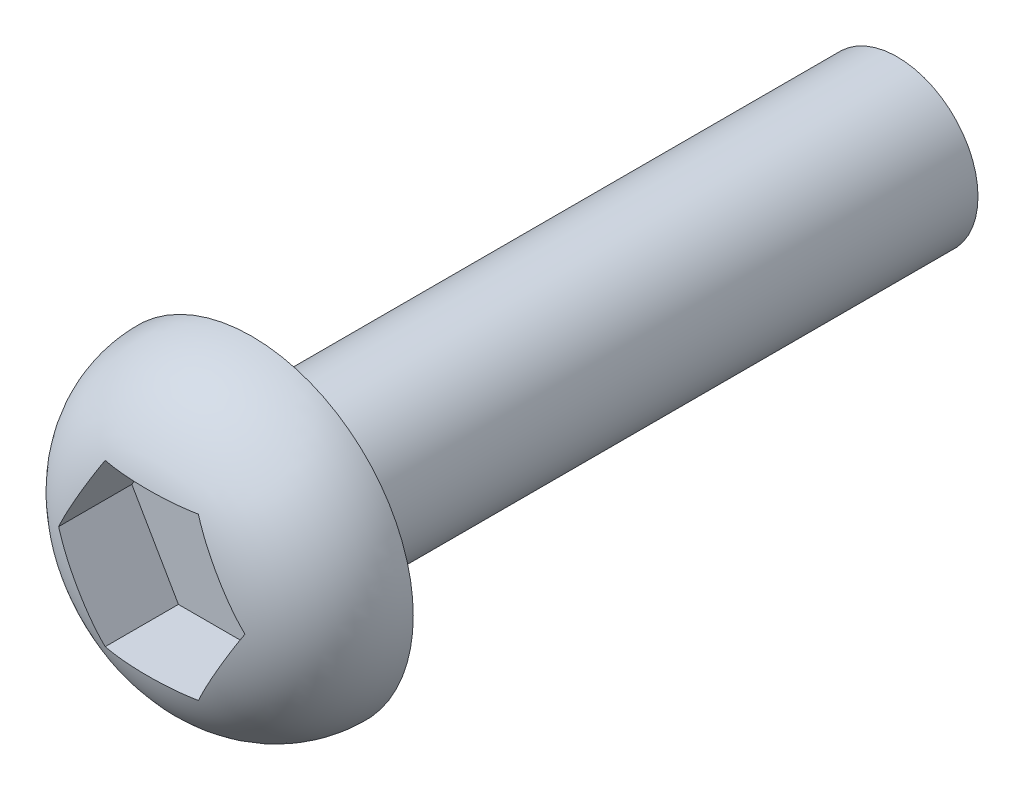
ISO-10303-21;
HEADER;
FILE_DESCRIPTION(('STEP AP214'),'2;1');
FILE_NAME('part.step','',(''),(''),'','','');
FILE_SCHEMA(('AUTOMOTIVE_DESIGN { 1 0 10303 214 1 1 1 1 }'));
ENDSEC;
DATA;
#1=APPLICATION_CONTEXT('core data for automotive mechanical design processes');
#2=APPLICATION_PROTOCOL_DEFINITION('international standard','automotive_design',2000,#1);
#3=PRODUCT_CONTEXT('',#1,'mechanical');
#4=PRODUCT('Part','Part','',(#3));
#5=PRODUCT_RELATED_PRODUCT_CATEGORY('part','',(#4));
#6=PRODUCT_DEFINITION_FORMATION('','',#4);
#7=PRODUCT_DEFINITION_CONTEXT('part definition',#1,'design');
#8=PRODUCT_DEFINITION('design','',#6,#7);
#9=PRODUCT_DEFINITION_SHAPE('','',#8);
#10=(LENGTH_UNIT() NAMED_UNIT(*) SI_UNIT(.MILLI.,.METRE.));
#11=(NAMED_UNIT(*) PLANE_ANGLE_UNIT() SI_UNIT($,.RADIAN.));
#12=(NAMED_UNIT(*) SI_UNIT($,.STERADIAN.) SOLID_ANGLE_UNIT());
#13=UNCERTAINTY_MEASURE_WITH_UNIT(LENGTH_MEASURE(1.E-05),#10,'distance_accuracy_value','');
#14=(GEOMETRIC_REPRESENTATION_CONTEXT(3) GLOBAL_UNCERTAINTY_ASSIGNED_CONTEXT((#13)) GLOBAL_UNIT_ASSIGNED_CONTEXT((#10,
#11,#12)) REPRESENTATION_CONTEXT('',''));
#15=CARTESIAN_POINT('',(0.,0.,0.));
#16=DIRECTION('',(0.,0.,1.));
#17=DIRECTION('',(1.,0.,0.));
#18=AXIS2_PLACEMENT_3D('',#15,#16,#17);
#19=CARTESIAN_POINT('',(0.,0.,12.));
#20=DIRECTION('',(0.,0.,-1.));
#21=DIRECTION('',(-1.,0.,0.));
#22=AXIS2_PLACEMENT_3D('',#19,#20,#21);
#23=CYLINDRICAL_SURFACE('',#22,1.5);
#24=CARTESIAN_POINT('',(0.,0.,12.));
#25=DIRECTION('',(0.,0.,1.));
#26=DIRECTION('',(1.,0.,0.));
#27=AXIS2_PLACEMENT_3D('',#24,#25,#26);
#28=CIRCLE('',#27,1.5);
#29=CARTESIAN_POINT('',(1.5,0.,12.));
#30=VERTEX_POINT('',#29);
#31=EDGE_CURVE('E136',#30,#30,#28,.T.);
#32=ORIENTED_EDGE('',*,*,#31,.F.);
#33=EDGE_LOOP('',(#32));
#34=FACE_BOUND('',#33,.T.);
#35=CARTESIAN_POINT('',(0.,0.,0.));
#36=DIRECTION('',(0.,0.,1.));
#37=DIRECTION('',(1.,0.,0.));
#38=AXIS2_PLACEMENT_3D('',#35,#36,#37);
#39=CIRCLE('',#38,1.5);
#40=CARTESIAN_POINT('',(1.5,0.,0.));
#41=VERTEX_POINT('',#40);
#42=EDGE_CURVE('E135',#41,#41,#39,.T.);
#43=ORIENTED_EDGE('',*,*,#42,.T.);
#44=EDGE_LOOP('',(#43));
#45=FACE_BOUND('',#44,.T.);
#46=ADVANCED_FACE('F33',(#34,#45),#23,.T.);
#47=CARTESIAN_POINT('',(0.,0.,0.));
#48=DIRECTION('',(0.,0.,1.));
#49=DIRECTION('',(1.,0.,0.));
#50=AXIS2_PLACEMENT_3D('',#47,#48,#49);
#51=PLANE('',#50);
#52=ORIENTED_EDGE('',*,*,#42,.F.);
#53=EDGE_LOOP('',(#52));
#54=FACE_BOUND('',#53,.T.);
#55=ADVANCED_FACE('F198',(#54),#51,.F.);
#56=CARTESIAN_POINT('',(0.,0.,12.));
#57=DIRECTION('',(0.,0.,1.));
#58=DIRECTION('',(1.,0.,0.));
#59=AXIS2_PLACEMENT_3D('',#56,#57,#58);
#60=PLANE('',#59);
#61=CARTESIAN_POINT('',(0.,0.,12.));
#62=DIRECTION('',(0.,0.,1.));
#63=DIRECTION('',(1.,0.,0.));
#64=AXIS2_PLACEMENT_3D('',#61,#62,#63);
#65=CIRCLE('',#64,3.);
#66=CARTESIAN_POINT('',(3.,0.,12.));
#67=VERTEX_POINT('',#66);
#68=EDGE_CURVE('E122',#67,#67,#65,.T.);
#69=ORIENTED_EDGE('',*,*,#68,.F.);
#70=EDGE_LOOP('',(#69));
#71=FACE_BOUND('',#70,.T.);
#72=ORIENTED_EDGE('',*,*,#31,.T.);
#73=EDGE_LOOP('',(#72));
#74=FACE_BOUND('',#73,.T.);
#75=ADVANCED_FACE('F203',(#71,#74),#60,.F.);
#76=CARTESIAN_POINT('',(-0.866025403784439,1.5,12.5));
#77=DIRECTION('',(-0.866025403784439,0.5,0.));
#78=DIRECTION('',(-0.5,-0.866025403784439,0.));
#79=AXIS2_PLACEMENT_3D('',#76,#77,#78);
#80=PLANE('',#79);
#81=DIRECTION('',(0.,0.,1.));
#82=VECTOR('',#81,1.);
#83=CARTESIAN_POINT('',(-0.866025403784439,1.5,12.5));
#84=LINE('',#83,#82);
#85=CARTESIAN_POINT('',(-0.866025403784439,1.5,12.5));
#86=VERTEX_POINT('',#85);
#87=CARTESIAN_POINT('',(-0.866025403784439,1.5,13.8612097182042));
#88=VERTEX_POINT('',#87);
#89=EDGE_CURVE('E120',#86,#88,#84,.T.);
#90=ORIENTED_EDGE('',*,*,#89,.T.);
#91=CARTESIAN_POINT('',(-0.866025403784439,1.5,13.8612097182042));
#92=CARTESIAN_POINT('',(-0.897391833782377,1.44567174959152,13.873540669486));
#93=CARTESIAN_POINT('',(-0.92892464211222,1.3910553234589,13.8840270776398));
#94=CARTESIAN_POINT('',(-0.992194875631696,1.28146806439642,13.9017855509481));
#95=CARTESIAN_POINT('',(-1.02393213830263,1.2264975129572,13.9090599102433));
#96=CARTESIAN_POINT('',(-1.08758914147633,1.11624034920279,13.9208966036249));
#97=CARTESIAN_POINT('',(-1.1195091148967,1.06095333346245,13.9254537237836));
#98=CARTESIAN_POINT('',(-1.18341628184974,0.950262873332008,13.9322194029191));
#99=CARTESIAN_POINT('',(-1.21540348834683,0.894859406486848,13.9344274572888));
#100=CARTESIAN_POINT('',(-1.27890034418602,0.784879626052498,13.9366974105321));
#101=CARTESIAN_POINT('',(-1.31040969197492,0.730303834768754,13.9367921199929));
#102=CARTESIAN_POINT('',(-1.37340849088617,0.621186714238655,13.9349234900065));
#103=CARTESIAN_POINT('',(-1.40489794209129,0.566645384848934,13.9329601591783));
#104=CARTESIAN_POINT('',(-1.49923820258182,0.403243260480049,13.923728512142));
#105=CARTESIAN_POINT('',(-1.56203785066875,0.294471079296033,13.9131219149723));
#106=CARTESIAN_POINT('',(-1.63341853637605,0.170836104971893,13.8940897813908));
#107=CARTESIAN_POINT('',(-1.64241142987999,0.155259956516006,13.8915642086321));
#108=CARTESIAN_POINT('',(-1.66037717256051,0.124142377397642,13.8862479221302));
#109=CARTESIAN_POINT('',(-1.66935002317047,0.108600944252471,13.883457228012));
#110=CARTESIAN_POINT('',(-1.68729243270645,0.077523779325944,13.8775937025368));
#111=CARTESIAN_POINT('',(-1.69626194313293,0.0619881315482519,13.8745202778371));
#112=CARTESIAN_POINT('',(-1.71417611106361,0.0309598825170042,13.8680845140849));
#113=CARTESIAN_POINT('',(-1.72312076544713,0.0154672866685937,13.8647221403093));
#114=CARTESIAN_POINT('',(-1.73205080756888,0.,13.8612097182042));
#115=B_SPLINE_CURVE_WITH_KNOTS('',3,(#91,#92,#93,#94,#95,#96,#97,#98,#99,#100,#101,#102,#103,
#104,#105,#106,#107,#108,#109,#110,#111,#112,#113,#114),.UNSPECIFIED.,.F.,.F.,(4,2,2,2,2,2,2,2,
2,2,2,4),(0.,0.191730055441622,0.38332294920206,0.575282304399829,0.767282886407718,
0.956300467202216,1.14531725641134,1.52288979850461,1.57737568295163,1.63185753733722,
1.68645645667214,1.74106194637516),.UNSPECIFIED.);
#116=CARTESIAN_POINT('',(-1.73205080756888,0.,13.8612097182042));
#117=VERTEX_POINT('',#116);
#118=EDGE_CURVE('E60',#88,#117,#115,.T.);
#119=ORIENTED_EDGE('',*,*,#118,.T.);
#120=DIRECTION('',(0.,0.,1.));
#121=VECTOR('',#120,1.);
#122=CARTESIAN_POINT('',(-1.73205080756888,0.,12.5));
#123=LINE('',#122,#121);
#124=CARTESIAN_POINT('',(-1.73205080756888,0.,12.5));
#125=VERTEX_POINT('',#124);
#126=EDGE_CURVE('E91',#125,#117,#123,.T.);
#127=ORIENTED_EDGE('',*,*,#126,.F.);
#128=DIRECTION('',(-0.5,-0.866025403784439,0.));
#129=VECTOR('',#128,1.);
#130=CARTESIAN_POINT('',(-0.866025403784439,1.5,12.5));
#131=LINE('',#130,#129);
#132=EDGE_CURVE('E95',#86,#125,#131,.T.);
#133=ORIENTED_EDGE('',*,*,#132,.F.);
#134=EDGE_LOOP('',(#90,#119,#127,#133));
#135=FACE_BOUND('',#134,.T.);
#136=ADVANCED_FACE('F93',(#135),#80,.F.);
#137=CARTESIAN_POINT('',(0.866025403784439,1.5,12.5));
#138=DIRECTION('',(0.,1.,0.));
#139=DIRECTION('',(0.,0.,1.));
#140=AXIS2_PLACEMENT_3D('',#137,#138,#139);
#141=PLANE('',#140);
#142=DIRECTION('',(0.,0.,1.));
#143=VECTOR('',#142,1.);
#144=CARTESIAN_POINT('',(0.866025403784439,1.5,12.5));
#145=LINE('',#144,#143);
#146=CARTESIAN_POINT('',(0.866025403784439,1.5,12.5));
#147=VERTEX_POINT('',#146);
#148=CARTESIAN_POINT('',(0.866025403784439,1.5,13.8612097182042));
#149=VERTEX_POINT('',#148);
#150=EDGE_CURVE('E123',#147,#149,#145,.T.);
#151=ORIENTED_EDGE('',*,*,#150,.T.);
#152=CARTESIAN_POINT('',(0.866025403784439,1.5,13.8612097182042));
#153=CARTESIAN_POINT('',(0.803292543788564,1.5,13.873540669486));
#154=CARTESIAN_POINT('',(0.740226927128877,1.5,13.8840270776398));
#155=CARTESIAN_POINT('',(0.613686460089926,1.5,13.9017855509481));
#156=CARTESIAN_POINT('',(0.550211934748056,1.5,13.9090599102433));
#157=CARTESIAN_POINT('',(0.422897928400666,1.5,13.9208966036249));
#158=CARTESIAN_POINT('',(0.359057981559912,1.5,13.9254537237836));
#159=CARTESIAN_POINT('',(0.231243647653844,1.5,13.9322194029191));
#160=CARTESIAN_POINT('',(0.167269234659662,1.5,13.9344274572888));
#161=CARTESIAN_POINT('',(0.0402755229812862,1.5,13.9366974105321));
#162=CARTESIAN_POINT('',(-0.0227431725965268,1.5,13.9367921199929));
#163=CARTESIAN_POINT('',(-0.148740770419026,1.5,13.9349234900065));
#164=CARTESIAN_POINT('',(-0.211719672829257,1.5,13.9329601591783));
#165=CARTESIAN_POINT('',(-0.400400193810322,1.5,13.923728512142));
#166=CARTESIAN_POINT('',(-0.525999489984191,1.5,13.9131219149723));
#167=CARTESIAN_POINT('',(-0.66876086139878,1.5,13.8940897813908));
#168=CARTESIAN_POINT('',(-0.686746648406669,1.5,13.8915642086321));
#169=CARTESIAN_POINT('',(-0.722678133767702,1.5,13.8862479221302));
#170=CARTESIAN_POINT('',(-0.740623834987616,1.5,13.883457228012));
#171=CARTESIAN_POINT('',(-0.776508654059577,1.5,13.8775937025368));
#172=CARTESIAN_POINT('',(-0.794447674912549,1.5,13.8745202778371));
#173=CARTESIAN_POINT('',(-0.830276010773896,1.5,13.8680845140849));
#174=CARTESIAN_POINT('',(-0.848165319540947,1.5,13.8647221403093));
#175=CARTESIAN_POINT('',(-0.866025403784443,1.5,13.8612097182042));
#176=B_SPLINE_CURVE_WITH_KNOTS('',3,(#152,#153,#154,#155,#156,#157,#158,#159,#160,#161,#162,
#163,#164,#165,#166,#167,#168,#169,#170,#171,#172,#173,#174,#175),.UNSPECIFIED.,.F.,.F.,(4,2,2,
2,2,2,2,2,2,2,2,4),(0.,0.191730055441623,0.38332294920206,0.57528230439983,0.767282886407718,
0.956300467202216,1.14531725641134,1.52288979850462,1.57737568295163,1.63185753733722,
1.68645645667214,1.74106194637516),.UNSPECIFIED.);
#177=EDGE_CURVE('E179',#149,#88,#176,.T.);
#178=ORIENTED_EDGE('',*,*,#177,.T.);
#179=ORIENTED_EDGE('',*,*,#89,.F.);
#180=DIRECTION('',(-1.,0.,0.));
#181=VECTOR('',#180,1.);
#182=CARTESIAN_POINT('',(0.866025403784439,1.5,12.5));
#183=LINE('',#182,#181);
#184=EDGE_CURVE('E98',#147,#86,#183,.T.);
#185=ORIENTED_EDGE('',*,*,#184,.F.);
#186=EDGE_LOOP('',(#151,#178,#179,#185));
#187=FACE_BOUND('',#186,.T.);
#188=ADVANCED_FACE('F187',(#187),#141,.F.);
#189=CARTESIAN_POINT('',(1.73205080756888,0.,12.5));
#190=DIRECTION('',(0.866025403784438,0.5,0.));
#191=DIRECTION('',(-0.5,0.866025403784439,0.));
#192=AXIS2_PLACEMENT_3D('',#189,#190,#191);
#193=PLANE('',#192);
#194=DIRECTION('',(0.,0.,1.));
#195=VECTOR('',#194,1.);
#196=CARTESIAN_POINT('',(1.73205080756888,0.,12.5));
#197=LINE('',#196,#195);
#198=CARTESIAN_POINT('',(1.73205080756888,0.,12.5));
#199=VERTEX_POINT('',#198);
#200=CARTESIAN_POINT('',(1.73205080756888,0.,13.8612097182042));
#201=VERTEX_POINT('',#200);
#202=EDGE_CURVE('E126',#199,#201,#197,.T.);
#203=ORIENTED_EDGE('',*,*,#202,.T.);
#204=CARTESIAN_POINT('',(1.73205080756888,0.,13.8612097182042));
#205=CARTESIAN_POINT('',(1.70068437757094,0.0543282504084815,13.873540669486));
#206=CARTESIAN_POINT('',(1.6691515692411,0.108944676541101,13.8840270776398));
#207=CARTESIAN_POINT('',(1.60588133572162,0.21853193560358,13.9017855509481));
#208=CARTESIAN_POINT('',(1.57414407305069,0.273502487042798,13.9090599102433));
#209=CARTESIAN_POINT('',(1.51048706987699,0.383759650797211,13.9208966036249));
#210=CARTESIAN_POINT('',(1.47856709645661,0.439046666537552,13.9254537237836));
#211=CARTESIAN_POINT('',(1.41465992950358,0.549737126667993,13.9322194029191));
#212=CARTESIAN_POINT('',(1.38267272300649,0.605140593513153,13.9344274572888));
#213=CARTESIAN_POINT('',(1.3191758671673,0.715120373947503,13.9366974105321));
#214=CARTESIAN_POINT('',(1.2876665193784,0.769696165231247,13.9367921199929));
#215=CARTESIAN_POINT('',(1.22466772046715,0.878813285761346,13.9349234900065));
#216=CARTESIAN_POINT('',(1.19317826926203,0.933354615151067,13.9329601591783));
#217=CARTESIAN_POINT('',(1.0988380087715,1.09675673951995,13.923728512142));
#218=CARTESIAN_POINT('',(1.03603836068456,1.20552892070397,13.9131219149723));
#219=CARTESIAN_POINT('',(0.964657674977269,1.32916389502811,13.8940897813908));
#220=CARTESIAN_POINT('',(0.955664781473325,1.344740043484,13.8915642086321));
#221=CARTESIAN_POINT('',(0.937699038792808,1.37585762260236,13.8862479221302));
#222=CARTESIAN_POINT('',(0.928726188182851,1.39139905574753,13.883457228012));
#223=CARTESIAN_POINT('',(0.91078377864687,1.42247622067406,13.8775937025368));
#224=CARTESIAN_POINT('',(0.901814268220384,1.43801186845175,13.8745202778371));
#225=CARTESIAN_POINT('',(0.883900100289711,1.469040117483,13.8680845140849));
#226=CARTESIAN_POINT('',(0.874955445906185,1.48453271333141,13.8647221403093));
#227=CARTESIAN_POINT('',(0.866025403784437,1.5,13.8612097182042));
#228=B_SPLINE_CURVE_WITH_KNOTS('',3,(#204,#205,#206,#207,#208,#209,#210,#211,#212,#213,#214,
#215,#216,#217,#218,#219,#220,#221,#222,#223,#224,#225,#226,#227),.UNSPECIFIED.,.F.,.F.,(4,2,2,
2,2,2,2,2,2,2,2,4),(0.,0.191730055441622,0.383322949202059,0.575282304399829,0.767282886407718,
0.956300467202215,1.14531725641134,1.52288979850461,1.57737568295163,1.63185753733722,
1.68645645667214,1.74106194637516),.UNSPECIFIED.);
#229=EDGE_CURVE('E183',#201,#149,#228,.T.);
#230=ORIENTED_EDGE('',*,*,#229,.T.);
#231=ORIENTED_EDGE('',*,*,#150,.F.);
#232=DIRECTION('',(-0.5,0.866025403784439,0.));
#233=VECTOR('',#232,1.);
#234=CARTESIAN_POINT('',(1.73205080756888,0.,12.5));
#235=LINE('',#234,#233);
#236=EDGE_CURVE('E117',#199,#147,#235,.T.);
#237=ORIENTED_EDGE('',*,*,#236,.F.);
#238=EDGE_LOOP('',(#203,#230,#231,#237));
#239=FACE_BOUND('',#238,.T.);
#240=ADVANCED_FACE('F157',(#239),#193,.F.);
#241=CARTESIAN_POINT('',(0.866025403784439,-1.5,12.5));
#242=DIRECTION('',(0.866025403784439,-0.5,0.));
#243=DIRECTION('',(0.5,0.866025403784439,0.));
#244=AXIS2_PLACEMENT_3D('',#241,#242,#243);
#245=PLANE('',#244);
#246=CARTESIAN_POINT('',(0.866025403784439,-1.5,13.8612097182042));
#247=CARTESIAN_POINT('',(0.901687627571185,-1.43823121649047,13.875223918404));
#248=CARTESIAN_POINT('',(0.937559130096784,-1.37609995157229,13.8868599742112));
#249=CARTESIAN_POINT('',(1.00949437465742,-1.25150445313838,13.9060490823375));
#250=CARTESIAN_POINT('',(1.045557492634,-1.18904130052359,13.9136113752359));
#251=CARTESIAN_POINT('',(1.11778972105316,-1.06393141095769,13.9253798818946));
#252=CARTESIAN_POINT('',(1.15395874636885,-1.00128482145067,13.9295882956594));
#253=CARTESIAN_POINT('',(1.20829227366648,-0.907176391616745,13.9337537462774));
#254=CARTESIAN_POINT('',(1.22643804728202,-0.875746989771989,13.9347843119323));
#255=CARTESIAN_POINT('',(1.26273515135863,-0.812878561343672,13.9361516574462));
#256=CARTESIAN_POINT('',(1.28088648145046,-0.781439535399668,13.9364884762599));
#257=CARTESIAN_POINT('',(1.29903810567666,-0.750000000000001,13.9364916731037));
#258=B_SPLINE_CURVE_WITH_KNOTS('',3,(#246,#247,#248,#249,#250,#251,#252,#253,#254,#255,#256,
#257),.UNSPECIFIED.,.F.,.F.,(4,2,2,2,2,4),(0.,0.217955055816693,0.43541361649161,
0.652729415755339,0.76164233621105,0.870549140896615),.UNSPECIFIED.);
#259=CARTESIAN_POINT('',(0.866025403784439,-1.5,13.8612097182042));
#260=VERTEX_POINT('',#259);
#261=CARTESIAN_POINT('',(1.29903810567666,-0.75,13.9364916731037));
#262=VERTEX_POINT('',#261);
#263=EDGE_CURVE('E139',#260,#262,#258,.T.);
#264=ORIENTED_EDGE('',*,*,#263,.T.);
#265=CARTESIAN_POINT('',(1.29903810567666,-0.75,13.9364916731037));
#266=CARTESIAN_POINT('',(1.31718972990285,-0.718560464600333,13.9364884762599));
#267=CARTESIAN_POINT('',(1.33534105999468,-0.687121438656329,13.9361516574462));
#268=CARTESIAN_POINT('',(1.3716381640713,-0.624253010228012,13.9347843119323));
#269=CARTESIAN_POINT('',(1.38978393768684,-0.592823608383256,13.9337537462774));
#270=CARTESIAN_POINT('',(1.44411746498447,-0.498715178549331,13.9295882956594));
#271=CARTESIAN_POINT('',(1.48028649030016,-0.436068589042312,13.9253798818946));
#272=CARTESIAN_POINT('',(1.55251871871932,-0.310958699476411,13.9136113752359));
#273=CARTESIAN_POINT('',(1.5885818366959,-0.248495546861616,13.9060490823375));
#274=CARTESIAN_POINT('',(1.66051708125653,-0.123900048427707,13.8868599742112));
#275=CARTESIAN_POINT('',(1.69638858378213,-0.0617687835095337,13.875223918404));
#276=CARTESIAN_POINT('',(1.73205080756888,0.,13.8612097182042));
#277=B_SPLINE_CURVE_WITH_KNOTS('',3,(#265,#266,#267,#268,#269,#270,#271,#272,#273,#274,#275,
#276),.UNSPECIFIED.,.F.,.F.,(4,2,2,2,2,4),(0.,0.108906804685565,0.217819725141276,
0.435135524405006,0.652594085079923,0.870549140896616),.UNSPECIFIED.);
#278=EDGE_CURVE('E147',#262,#201,#277,.T.);
#279=ORIENTED_EDGE('',*,*,#278,.T.);
#280=ORIENTED_EDGE('',*,*,#202,.F.);
#281=DIRECTION('',(0.5,0.866025403784439,0.));
#282=VECTOR('',#281,1.);
#283=CARTESIAN_POINT('',(0.866025403784439,-1.5,12.5));
#284=LINE('',#283,#282);
#285=CARTESIAN_POINT('',(0.866025403784439,-1.5,12.5));
#286=VERTEX_POINT('',#285);
#287=EDGE_CURVE('E114',#286,#199,#284,.T.);
#288=ORIENTED_EDGE('',*,*,#287,.F.);
#289=DIRECTION('',(0.,0.,1.));
#290=VECTOR('',#289,1.);
#291=CARTESIAN_POINT('',(0.866025403784439,-1.5,12.5));
#292=LINE('',#291,#290);
#293=EDGE_CURVE('E129',#286,#260,#292,.T.);
#294=ORIENTED_EDGE('',*,*,#293,.T.);
#295=EDGE_LOOP('',(#264,#279,#280,#288,#294));
#296=FACE_BOUND('',#295,.T.);
#297=ADVANCED_FACE('F152',(#296),#245,.F.);
#298=CARTESIAN_POINT('',(-0.866025403784439,-1.5,12.5));
#299=DIRECTION('',(0.,-1.,0.));
#300=DIRECTION('',(0.,0.,-1.));
#301=AXIS2_PLACEMENT_3D('',#298,#299,#300);
#302=PLANE('',#301);
#303=DIRECTION('',(0.,0.,1.));
#304=VECTOR('',#303,1.);
#305=CARTESIAN_POINT('',(-0.866025403784439,-1.5,12.5));
#306=LINE('',#305,#304);
#307=CARTESIAN_POINT('',(-0.866025403784439,-1.5,12.5));
#308=VERTEX_POINT('',#307);
#309=CARTESIAN_POINT('',(-0.866025403784439,-1.5,13.8612097182042));
#310=VERTEX_POINT('',#309);
#311=EDGE_CURVE('E97',#308,#310,#306,.T.);
#312=ORIENTED_EDGE('',*,*,#311,.T.);
#313=CARTESIAN_POINT('',(-0.866025403784439,-1.5,13.8612097182042));
#314=CARTESIAN_POINT('',(-0.803292543788563,-1.5,13.873540669486));
#315=CARTESIAN_POINT('',(-0.740226927128876,-1.5,13.8840270776398));
#316=CARTESIAN_POINT('',(-0.613686460089925,-1.5,13.9017855509481));
#317=CARTESIAN_POINT('',(-0.550211934748056,-1.5,13.9090599102433));
#318=CARTESIAN_POINT('',(-0.422897928400666,-1.5,13.9208966036249));
#319=CARTESIAN_POINT('',(-0.359057981559912,-1.5,13.9254537237836));
#320=CARTESIAN_POINT('',(-0.231243647653844,-1.5,13.9322194029191));
#321=CARTESIAN_POINT('',(-0.167269234659662,-1.5,13.9344274572888));
#322=CARTESIAN_POINT('',(-0.0402755229812864,-1.5,13.9366974105321));
#323=CARTESIAN_POINT('',(0.0227431725965266,-1.5,13.9367921199929));
#324=CARTESIAN_POINT('',(0.148740770419026,-1.5,13.9349234900065));
#325=CARTESIAN_POINT('',(0.211719672829256,-1.5,13.9329601591783));
#326=CARTESIAN_POINT('',(0.400400193810322,-1.5,13.923728512142));
#327=CARTESIAN_POINT('',(0.525999489984191,-1.5,13.9131219149723));
#328=CARTESIAN_POINT('',(0.66876086139878,-1.5,13.8940897813908));
#329=CARTESIAN_POINT('',(0.686746648406669,-1.5,13.8915642086321));
#330=CARTESIAN_POINT('',(0.722678133767702,-1.5,13.8862479221302));
#331=CARTESIAN_POINT('',(0.740623834987616,-1.5,13.883457228012));
#332=CARTESIAN_POINT('',(0.776508654059578,-1.5,13.8775937025368));
#333=CARTESIAN_POINT('',(0.794447674912549,-1.5,13.8745202778371));
#334=CARTESIAN_POINT('',(0.830276010773896,-1.5,13.8680845140849));
#335=CARTESIAN_POINT('',(0.848165319540948,-1.5,13.8647221403093));
#336=CARTESIAN_POINT('',(0.866025403784444,-1.5,13.8612097182042));
#337=B_SPLINE_CURVE_WITH_KNOTS('',3,(#313,#314,#315,#316,#317,#318,#319,#320,#321,#322,#323,
#324,#325,#326,#327,#328,#329,#330,#331,#332,#333,#334,#335,#336),.UNSPECIFIED.,.F.,.F.,(4,2,2,
2,2,2,2,2,2,2,2,4),(0.,0.191730055441623,0.38332294920206,0.57528230439983,0.767282886407718,
0.956300467202215,1.14531725641134,1.52288979850462,1.57737568295163,1.63185753733722,
1.68645645667214,1.74106194637516),.UNSPECIFIED.);
#338=EDGE_CURVE('E11',#310,#260,#337,.T.);
#339=ORIENTED_EDGE('',*,*,#338,.T.);
#340=ORIENTED_EDGE('',*,*,#293,.F.);
#341=DIRECTION('',(1.,0.,0.));
#342=VECTOR('',#341,1.);
#343=CARTESIAN_POINT('',(-0.866025403784439,-1.5,12.5));
#344=LINE('',#343,#342);
#345=EDGE_CURVE('E106',#308,#286,#344,.T.);
#346=ORIENTED_EDGE('',*,*,#345,.F.);
#347=EDGE_LOOP('',(#312,#339,#340,#346));
#348=FACE_BOUND('',#347,.T.);
#349=ADVANCED_FACE('F156',(#348),#302,.F.);
#350=CARTESIAN_POINT('',(-1.73205080756888,0.,12.5));
#351=DIRECTION('',(-0.866025403784439,-0.5,0.));
#352=DIRECTION('',(0.5,-0.866025403784439,0.));
#353=AXIS2_PLACEMENT_3D('',#350,#351,#352);
#354=PLANE('',#353);
#355=ORIENTED_EDGE('',*,*,#126,.T.);
#356=CARTESIAN_POINT('',(-1.73205080756888,0.,13.8612097182042));
#357=CARTESIAN_POINT('',(-1.70068437757094,-0.0543282504084816,13.873540669486));
#358=CARTESIAN_POINT('',(-1.6691515692411,-0.108944676541101,13.8840270776398));
#359=CARTESIAN_POINT('',(-1.60588133572162,-0.21853193560358,13.9017855509481));
#360=CARTESIAN_POINT('',(-1.57414407305069,-0.273502487042798,13.9090599102433));
#361=CARTESIAN_POINT('',(-1.51048706987699,-0.383759650797212,13.9208966036249));
#362=CARTESIAN_POINT('',(-1.47856709645661,-0.439046666537552,13.9254537237836));
#363=CARTESIAN_POINT('',(-1.41465992950358,-0.549737126667994,13.9322194029191));
#364=CARTESIAN_POINT('',(-1.38267272300649,-0.605140593513153,13.9344274572888));
#365=CARTESIAN_POINT('',(-1.3191758671673,-0.715120373947503,13.9366974105321));
#366=CARTESIAN_POINT('',(-1.2876665193784,-0.769696165231247,13.9367921199929));
#367=CARTESIAN_POINT('',(-1.22466772046715,-0.878813285761346,13.9349234900065));
#368=CARTESIAN_POINT('',(-1.19317826926203,-0.933354615151067,13.9329601591783));
#369=CARTESIAN_POINT('',(-1.0988380087715,-1.09675673951995,13.923728512142));
#370=CARTESIAN_POINT('',(-1.03603836068456,-1.20552892070397,13.9131219149723));
#371=CARTESIAN_POINT('',(-0.964657674977268,-1.32916389502811,13.8940897813908));
#372=CARTESIAN_POINT('',(-0.955664781473324,-1.344740043484,13.8915642086321));
#373=CARTESIAN_POINT('',(-0.937699038792807,-1.37585762260236,13.8862479221302));
#374=CARTESIAN_POINT('',(-0.92872618818285,-1.39139905574753,13.883457228012));
#375=CARTESIAN_POINT('',(-0.91078377864687,-1.42247622067406,13.8775937025368));
#376=CARTESIAN_POINT('',(-0.901814268220384,-1.43801186845175,13.8745202778371));
#377=CARTESIAN_POINT('',(-0.883900100289711,-1.469040117483,13.8680845140849));
#378=CARTESIAN_POINT('',(-0.874955445906185,-1.48453271333141,13.8647221403093));
#379=CARTESIAN_POINT('',(-0.866025403784437,-1.5,13.8612097182042));
#380=B_SPLINE_CURVE_WITH_KNOTS('',3,(#356,#357,#358,#359,#360,#361,#362,#363,#364,#365,#366,
#367,#368,#369,#370,#371,#372,#373,#374,#375,#376,#377,#378,#379),.UNSPECIFIED.,.F.,.F.,(4,2,2,
2,2,2,2,2,2,2,2,4),(0.,0.191730055441623,0.38332294920206,0.57528230439983,0.767282886407718,
0.956300467202215,1.14531725641134,1.52288979850462,1.57737568295163,1.63185753733722,
1.68645645667214,1.74106194637516),.UNSPECIFIED.);
#381=EDGE_CURVE('E46',#117,#310,#380,.T.);
#382=ORIENTED_EDGE('',*,*,#381,.T.);
#383=ORIENTED_EDGE('',*,*,#311,.F.);
#384=DIRECTION('',(0.5,-0.866025403784439,0.));
#385=VECTOR('',#384,1.);
#386=CARTESIAN_POINT('',(-1.73205080756888,0.,12.5));
#387=LINE('',#386,#385);
#388=EDGE_CURVE('E101',#125,#308,#387,.T.);
#389=ORIENTED_EDGE('',*,*,#388,.F.);
#390=EDGE_LOOP('',(#355,#382,#383,#389));
#391=FACE_BOUND('',#390,.T.);
#392=ADVANCED_FACE('F102',(#391),#354,.F.);
#393=CARTESIAN_POINT('',(0.,0.,12.5));
#394=DIRECTION('',(0.,0.,1.));
#395=DIRECTION('',(1.,0.,0.));
#396=AXIS2_PLACEMENT_3D('',#393,#394,#395);
#397=PLANE('',#396);
#398=ORIENTED_EDGE('',*,*,#132,.T.);
#399=ORIENTED_EDGE('',*,*,#388,.T.);
#400=ORIENTED_EDGE('',*,*,#345,.T.);
#401=ORIENTED_EDGE('',*,*,#287,.T.);
#402=ORIENTED_EDGE('',*,*,#236,.T.);
#403=ORIENTED_EDGE('',*,*,#184,.T.);
#404=EDGE_LOOP('',(#398,#399,#400,#401,#402,#403));
#405=FACE_BOUND('',#404,.T.);
#406=ADVANCED_FACE('F108',(#405),#397,.T.);
#407=CARTESIAN_POINT('',(0.,0.,12.));
#408=DIRECTION('',(0.,0.,1.));
#409=DIRECTION('',(1.,0.,0.));
#410=AXIS2_PLACEMENT_3D('',#407,#408,#409);
#411=DEGENERATE_TOROIDAL_SURFACE('',#410,1.,2.,.T.);
#412=ORIENTED_EDGE('',*,*,#68,.T.);
#413=EDGE_LOOP('',(#412));
#414=FACE_BOUND('',#413,.T.);
#415=ORIENTED_EDGE('',*,*,#229,.F.);
#416=ORIENTED_EDGE('',*,*,#278,.F.);
#417=ORIENTED_EDGE('',*,*,#263,.F.);
#418=ORIENTED_EDGE('',*,*,#338,.F.);
#419=ORIENTED_EDGE('',*,*,#381,.F.);
#420=ORIENTED_EDGE('',*,*,#118,.F.);
#421=ORIENTED_EDGE('',*,*,#177,.F.);
#422=EDGE_LOOP('',(#415,#416,#417,#418,#419,#420,#421));
#423=FACE_BOUND('',#422,.T.);
#424=ADVANCED_FACE('F35',(#414,#423),#411,.T.);
#425=CLOSED_SHELL('',(#46,#55,#75,#136,#188,#240,#297,#349,#392,#406,#424));
#426=MANIFOLD_SOLID_BREP('B2',#425);
#427=ADVANCED_BREP_SHAPE_REPRESENTATION('',(#18,#426),#14);
#428=SHAPE_DEFINITION_REPRESENTATION(#9,#427);
ENDSEC;
END-ISO-10303-21;
